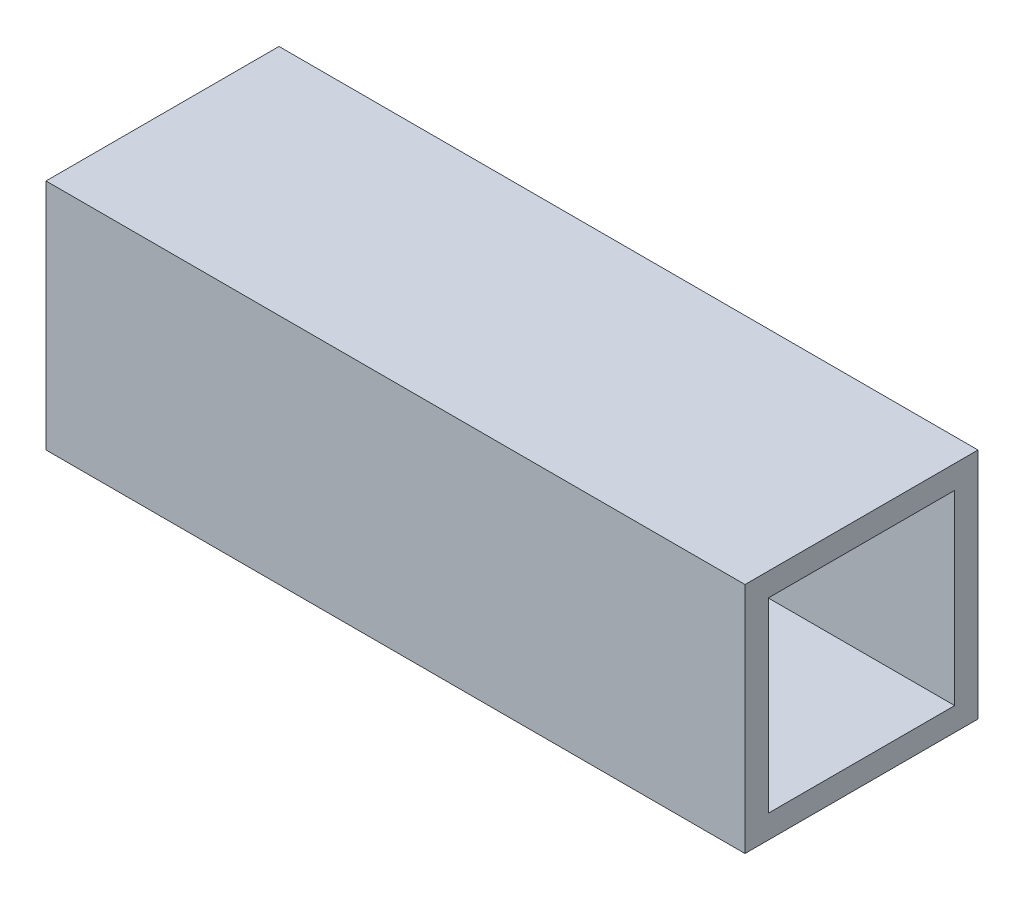
ISO-10303-21;
HEADER;
FILE_DESCRIPTION(('STEP AP214'),'2;1');
FILE_NAME('part.step','',(''),(''),'','','');
FILE_SCHEMA(('AUTOMOTIVE_DESIGN { 1 0 10303 214 1 1 1 1 }'));
ENDSEC;
DATA;
#1=APPLICATION_CONTEXT('core data for automotive mechanical design processes');
#2=APPLICATION_PROTOCOL_DEFINITION('international standard','automotive_design',2000,#1);
#3=PRODUCT_CONTEXT('',#1,'mechanical');
#4=PRODUCT('Part','Part','',(#3));
#5=PRODUCT_RELATED_PRODUCT_CATEGORY('part','',(#4));
#6=PRODUCT_DEFINITION_FORMATION('','',#4);
#7=PRODUCT_DEFINITION_CONTEXT('part definition',#1,'design');
#8=PRODUCT_DEFINITION('design','',#6,#7);
#9=PRODUCT_DEFINITION_SHAPE('','',#8);
#10=(LENGTH_UNIT() NAMED_UNIT(*) SI_UNIT(.MILLI.,.METRE.));
#11=(NAMED_UNIT(*) PLANE_ANGLE_UNIT() SI_UNIT($,.RADIAN.));
#12=(NAMED_UNIT(*) SI_UNIT($,.STERADIAN.) SOLID_ANGLE_UNIT());
#13=UNCERTAINTY_MEASURE_WITH_UNIT(LENGTH_MEASURE(1.E-05),#10,'distance_accuracy_value','');
#14=(GEOMETRIC_REPRESENTATION_CONTEXT(3) GLOBAL_UNCERTAINTY_ASSIGNED_CONTEXT((#13)) GLOBAL_UNIT_ASSIGNED_CONTEXT((#10,
#11,#12)) REPRESENTATION_CONTEXT('',''));
#15=CARTESIAN_POINT('',(0.,0.,0.));
#16=DIRECTION('',(0.,0.,1.));
#17=DIRECTION('',(1.,0.,0.));
#18=AXIS2_PLACEMENT_3D('',#15,#16,#17);
#19=CARTESIAN_POINT('',(45.,0.,0.));
#20=DIRECTION('',(1.,0.,0.));
#21=DIRECTION('',(0.,0.,-1.));
#22=AXIS2_PLACEMENT_3D('',#19,#20,#21);
#23=PLANE('',#22);
#24=DIRECTION('',(0.,1.,0.));
#25=VECTOR('',#24,1.);
#26=CARTESIAN_POINT('',(45.,7.5,-7.5));
#27=LINE('',#26,#25);
#28=CARTESIAN_POINT('',(45.,-7.5,-7.5));
#29=VERTEX_POINT('',#28);
#30=CARTESIAN_POINT('',(45.,7.5,-7.5));
#31=VERTEX_POINT('',#30);
#32=EDGE_CURVE('E134',#29,#31,#27,.T.);
#33=ORIENTED_EDGE('',*,*,#32,.T.);
#34=DIRECTION('',(0.,0.,1.));
#35=VECTOR('',#34,1.);
#36=CARTESIAN_POINT('',(45.,7.5,7.5));
#37=LINE('',#36,#35);
#38=CARTESIAN_POINT('',(45.,7.5,7.5));
#39=VERTEX_POINT('',#38);
#40=EDGE_CURVE('E137',#31,#39,#37,.T.);
#41=ORIENTED_EDGE('',*,*,#40,.T.);
#42=DIRECTION('',(0.,-1.,0.));
#43=VECTOR('',#42,1.);
#44=CARTESIAN_POINT('',(45.,7.5,7.5));
#45=LINE('',#44,#43);
#46=CARTESIAN_POINT('',(45.,-7.5,7.5));
#47=VERTEX_POINT('',#46);
#48=EDGE_CURVE('E140',#39,#47,#45,.T.);
#49=ORIENTED_EDGE('',*,*,#48,.T.);
#50=DIRECTION('',(0.,0.,-1.));
#51=VECTOR('',#50,1.);
#52=CARTESIAN_POINT('',(45.,-7.5,7.5));
#53=LINE('',#52,#51);
#54=EDGE_CURVE('E142',#47,#29,#53,.T.);
#55=ORIENTED_EDGE('',*,*,#54,.T.);
#56=EDGE_LOOP('',(#33,#41,#49,#55));
#57=FACE_BOUND('',#56,.T.);
#58=DIRECTION('',(0.,0.,-1.));
#59=VECTOR('',#58,1.);
#60=CARTESIAN_POINT('',(45.,-6.,6.));
#61=LINE('',#60,#59);
#62=CARTESIAN_POINT('',(45.,-6.,6.));
#63=VERTEX_POINT('',#62);
#64=CARTESIAN_POINT('',(45.,-6.,-6.));
#65=VERTEX_POINT('',#64);
#66=EDGE_CURVE('E106',#63,#65,#61,.T.);
#67=ORIENTED_EDGE('',*,*,#66,.F.);
#68=DIRECTION('',(0.,-1.,0.));
#69=VECTOR('',#68,1.);
#70=CARTESIAN_POINT('',(45.,6.,6.));
#71=LINE('',#70,#69);
#72=CARTESIAN_POINT('',(45.,6.,6.));
#73=VERTEX_POINT('',#72);
#74=EDGE_CURVE('E98',#73,#63,#71,.T.);
#75=ORIENTED_EDGE('',*,*,#74,.F.);
#76=DIRECTION('',(0.,0.,1.));
#77=VECTOR('',#76,1.);
#78=CARTESIAN_POINT('',(45.,6.,6.));
#79=LINE('',#78,#77);
#80=CARTESIAN_POINT('',(45.,6.,-6.));
#81=VERTEX_POINT('',#80);
#82=EDGE_CURVE('E120',#81,#73,#79,.T.);
#83=ORIENTED_EDGE('',*,*,#82,.F.);
#84=DIRECTION('',(0.,1.,0.));
#85=VECTOR('',#84,1.);
#86=CARTESIAN_POINT('',(45.,6.,-6.));
#87=LINE('',#86,#85);
#88=EDGE_CURVE('E118',#65,#81,#87,.T.);
#89=ORIENTED_EDGE('',*,*,#88,.F.);
#90=EDGE_LOOP('',(#67,#75,#83,#89));
#91=FACE_BOUND('',#90,.T.);
#92=ADVANCED_FACE('F33',(#57,#91),#23,.T.);
#93=CARTESIAN_POINT('',(0.,0.,0.));
#94=DIRECTION('',(1.,0.,0.));
#95=DIRECTION('',(0.,0.,-1.));
#96=AXIS2_PLACEMENT_3D('',#93,#94,#95);
#97=PLANE('',#96);
#98=DIRECTION('',(0.,1.,0.));
#99=VECTOR('',#98,1.);
#100=CARTESIAN_POINT('',(0.,7.5,-7.5));
#101=LINE('',#100,#99);
#102=CARTESIAN_POINT('',(0.,-7.5,-7.5));
#103=VERTEX_POINT('',#102);
#104=CARTESIAN_POINT('',(0.,7.5,-7.5));
#105=VERTEX_POINT('',#104);
#106=EDGE_CURVE('E114',#103,#105,#101,.T.);
#107=ORIENTED_EDGE('',*,*,#106,.F.);
#108=DIRECTION('',(0.,0.,-1.));
#109=VECTOR('',#108,1.);
#110=CARTESIAN_POINT('',(0.,-7.5,7.5));
#111=LINE('',#110,#109);
#112=CARTESIAN_POINT('',(0.,-7.5,7.5));
#113=VERTEX_POINT('',#112);
#114=EDGE_CURVE('E138',#113,#103,#111,.T.);
#115=ORIENTED_EDGE('',*,*,#114,.F.);
#116=DIRECTION('',(0.,-1.,0.));
#117=VECTOR('',#116,1.);
#118=CARTESIAN_POINT('',(0.,7.5,7.5));
#119=LINE('',#118,#117);
#120=CARTESIAN_POINT('',(0.,7.5,7.5));
#121=VERTEX_POINT('',#120);
#122=EDGE_CURVE('E149',#121,#113,#119,.T.);
#123=ORIENTED_EDGE('',*,*,#122,.F.);
#124=DIRECTION('',(0.,0.,1.));
#125=VECTOR('',#124,1.);
#126=CARTESIAN_POINT('',(0.,7.5,7.5));
#127=LINE('',#126,#125);
#128=EDGE_CURVE('E147',#105,#121,#127,.T.);
#129=ORIENTED_EDGE('',*,*,#128,.F.);
#130=EDGE_LOOP('',(#107,#115,#123,#129));
#131=FACE_BOUND('',#130,.T.);
#132=DIRECTION('',(0.,-1.,0.));
#133=VECTOR('',#132,1.);
#134=CARTESIAN_POINT('',(0.,6.,6.));
#135=LINE('',#134,#133);
#136=CARTESIAN_POINT('',(0.,6.,6.));
#137=VERTEX_POINT('',#136);
#138=CARTESIAN_POINT('',(0.,-6.,6.));
#139=VERTEX_POINT('',#138);
#140=EDGE_CURVE('E56',#137,#139,#135,.T.);
#141=ORIENTED_EDGE('',*,*,#140,.T.);
#142=DIRECTION('',(0.,0.,-1.));
#143=VECTOR('',#142,1.);
#144=CARTESIAN_POINT('',(0.,-6.,6.));
#145=LINE('',#144,#143);
#146=CARTESIAN_POINT('',(0.,-6.,-6.));
#147=VERTEX_POINT('',#146);
#148=EDGE_CURVE('E113',#139,#147,#145,.T.);
#149=ORIENTED_EDGE('',*,*,#148,.T.);
#150=DIRECTION('',(0.,1.,0.));
#151=VECTOR('',#150,1.);
#152=CARTESIAN_POINT('',(0.,6.,-6.));
#153=LINE('',#152,#151);
#154=CARTESIAN_POINT('',(0.,6.,-6.));
#155=VERTEX_POINT('',#154);
#156=EDGE_CURVE('E126',#147,#155,#153,.T.);
#157=ORIENTED_EDGE('',*,*,#156,.T.);
#158=DIRECTION('',(0.,0.,1.));
#159=VECTOR('',#158,1.);
#160=CARTESIAN_POINT('',(0.,6.,6.));
#161=LINE('',#160,#159);
#162=EDGE_CURVE('E107',#155,#137,#161,.T.);
#163=ORIENTED_EDGE('',*,*,#162,.T.);
#164=EDGE_LOOP('',(#141,#149,#157,#163));
#165=FACE_BOUND('',#164,.T.);
#166=ADVANCED_FACE('F167',(#131,#165),#97,.F.);
#167=CARTESIAN_POINT('',(45.,7.5,-7.5));
#168=DIRECTION('',(0.,0.,1.));
#169=DIRECTION('',(0.,-1.,0.));
#170=AXIS2_PLACEMENT_3D('',#167,#168,#169);
#171=PLANE('',#170);
#172=ORIENTED_EDGE('',*,*,#106,.T.);
#173=DIRECTION('',(-1.,0.,0.));
#174=VECTOR('',#173,1.);
#175=CARTESIAN_POINT('',(45.,7.5,-7.5));
#176=LINE('',#175,#174);
#177=EDGE_CURVE('E11',#31,#105,#176,.T.);
#178=ORIENTED_EDGE('',*,*,#177,.F.);
#179=ORIENTED_EDGE('',*,*,#32,.F.);
#180=DIRECTION('',(-1.,0.,0.));
#181=VECTOR('',#180,1.);
#182=CARTESIAN_POINT('',(45.,-7.5,-7.5));
#183=LINE('',#182,#181);
#184=EDGE_CURVE('E144',#29,#103,#183,.T.);
#185=ORIENTED_EDGE('',*,*,#184,.T.);
#186=EDGE_LOOP('',(#172,#178,#179,#185));
#187=FACE_BOUND('',#186,.T.);
#188=ADVANCED_FACE('F35',(#187),#171,.F.);
#189=CARTESIAN_POINT('',(45.,7.5,7.5));
#190=DIRECTION('',(0.,-1.,0.));
#191=DIRECTION('',(0.,0.,-1.));
#192=AXIS2_PLACEMENT_3D('',#189,#190,#191);
#193=PLANE('',#192);
#194=ORIENTED_EDGE('',*,*,#128,.T.);
#195=DIRECTION('',(-1.,0.,0.));
#196=VECTOR('',#195,1.);
#197=CARTESIAN_POINT('',(45.,7.5,7.5));
#198=LINE('',#197,#196);
#199=EDGE_CURVE('E41',#39,#121,#198,.T.);
#200=ORIENTED_EDGE('',*,*,#199,.F.);
#201=ORIENTED_EDGE('',*,*,#40,.F.);
#202=ORIENTED_EDGE('',*,*,#177,.T.);
#203=EDGE_LOOP('',(#194,#200,#201,#202));
#204=FACE_BOUND('',#203,.T.);
#205=ADVANCED_FACE('F177',(#204),#193,.F.);
#206=CARTESIAN_POINT('',(45.,7.5,7.5));
#207=DIRECTION('',(0.,0.,-1.));
#208=DIRECTION('',(0.,1.,0.));
#209=AXIS2_PLACEMENT_3D('',#206,#207,#208);
#210=PLANE('',#209);
#211=ORIENTED_EDGE('',*,*,#122,.T.);
#212=DIRECTION('',(-1.,0.,0.));
#213=VECTOR('',#212,1.);
#214=CARTESIAN_POINT('',(45.,-7.5,7.5));
#215=LINE('',#214,#213);
#216=EDGE_CURVE('E154',#47,#113,#215,.T.);
#217=ORIENTED_EDGE('',*,*,#216,.F.);
#218=ORIENTED_EDGE('',*,*,#48,.F.);
#219=ORIENTED_EDGE('',*,*,#199,.T.);
#220=EDGE_LOOP('',(#211,#217,#218,#219));
#221=FACE_BOUND('',#220,.T.);
#222=ADVANCED_FACE('F161',(#221),#210,.F.);
#223=CARTESIAN_POINT('',(45.,-7.5,7.5));
#224=DIRECTION('',(0.,1.,0.));
#225=DIRECTION('',(0.,0.,1.));
#226=AXIS2_PLACEMENT_3D('',#223,#224,#225);
#227=PLANE('',#226);
#228=ORIENTED_EDGE('',*,*,#114,.T.);
#229=ORIENTED_EDGE('',*,*,#184,.F.);
#230=ORIENTED_EDGE('',*,*,#54,.F.);
#231=ORIENTED_EDGE('',*,*,#216,.T.);
#232=EDGE_LOOP('',(#228,#229,#230,#231));
#233=FACE_BOUND('',#232,.T.);
#234=ADVANCED_FACE('F171',(#233),#227,.F.);
#235=CARTESIAN_POINT('',(45.,6.,6.));
#236=DIRECTION('',(0.,0.,-1.));
#237=DIRECTION('',(0.,1.,0.));
#238=AXIS2_PLACEMENT_3D('',#235,#236,#237);
#239=PLANE('',#238);
#240=ORIENTED_EDGE('',*,*,#140,.F.);
#241=DIRECTION('',(-1.,0.,0.));
#242=VECTOR('',#241,1.);
#243=CARTESIAN_POINT('',(45.,6.,6.));
#244=LINE('',#243,#242);
#245=EDGE_CURVE('E102',#73,#137,#244,.T.);
#246=ORIENTED_EDGE('',*,*,#245,.F.);
#247=ORIENTED_EDGE('',*,*,#74,.T.);
#248=DIRECTION('',(-1.,0.,0.));
#249=VECTOR('',#248,1.);
#250=CARTESIAN_POINT('',(45.,-6.,6.));
#251=LINE('',#250,#249);
#252=EDGE_CURVE('E101',#63,#139,#251,.T.);
#253=ORIENTED_EDGE('',*,*,#252,.T.);
#254=EDGE_LOOP('',(#240,#246,#247,#253));
#255=FACE_BOUND('',#254,.T.);
#256=ADVANCED_FACE('F100',(#255),#239,.T.);
#257=CARTESIAN_POINT('',(45.,-6.,6.));
#258=DIRECTION('',(0.,1.,0.));
#259=DIRECTION('',(0.,0.,1.));
#260=AXIS2_PLACEMENT_3D('',#257,#258,#259);
#261=PLANE('',#260);
#262=ORIENTED_EDGE('',*,*,#148,.F.);
#263=ORIENTED_EDGE('',*,*,#252,.F.);
#264=ORIENTED_EDGE('',*,*,#66,.T.);
#265=DIRECTION('',(-1.,0.,0.));
#266=VECTOR('',#265,1.);
#267=CARTESIAN_POINT('',(45.,-6.,-6.));
#268=LINE('',#267,#266);
#269=EDGE_CURVE('E115',#65,#147,#268,.T.);
#270=ORIENTED_EDGE('',*,*,#269,.T.);
#271=EDGE_LOOP('',(#262,#263,#264,#270));
#272=FACE_BOUND('',#271,.T.);
#273=ADVANCED_FACE('F110',(#272),#261,.T.);
#274=CARTESIAN_POINT('',(45.,6.,-6.));
#275=DIRECTION('',(0.,0.,1.));
#276=DIRECTION('',(0.,-1.,0.));
#277=AXIS2_PLACEMENT_3D('',#274,#275,#276);
#278=PLANE('',#277);
#279=ORIENTED_EDGE('',*,*,#156,.F.);
#280=ORIENTED_EDGE('',*,*,#269,.F.);
#281=ORIENTED_EDGE('',*,*,#88,.T.);
#282=DIRECTION('',(-1.,0.,0.));
#283=VECTOR('',#282,1.);
#284=CARTESIAN_POINT('',(45.,6.,-6.));
#285=LINE('',#284,#283);
#286=EDGE_CURVE('E48',#81,#155,#285,.T.);
#287=ORIENTED_EDGE('',*,*,#286,.T.);
#288=EDGE_LOOP('',(#279,#280,#281,#287));
#289=FACE_BOUND('',#288,.T.);
#290=ADVANCED_FACE('F200',(#289),#278,.T.);
#291=CARTESIAN_POINT('',(45.,6.,6.));
#292=DIRECTION('',(0.,-1.,0.));
#293=DIRECTION('',(0.,0.,-1.));
#294=AXIS2_PLACEMENT_3D('',#291,#292,#293);
#295=PLANE('',#294);
#296=ORIENTED_EDGE('',*,*,#162,.F.);
#297=ORIENTED_EDGE('',*,*,#286,.F.);
#298=ORIENTED_EDGE('',*,*,#82,.T.);
#299=ORIENTED_EDGE('',*,*,#245,.T.);
#300=EDGE_LOOP('',(#296,#297,#298,#299));
#301=FACE_BOUND('',#300,.T.);
#302=ADVANCED_FACE('F204',(#301),#295,.T.);
#303=CLOSED_SHELL('',(#92,#166,#188,#205,#222,#234,#256,#273,#290,#302));
#304=MANIFOLD_SOLID_BREP('B2',#303);
#305=ADVANCED_BREP_SHAPE_REPRESENTATION('',(#18,#304),#14);
#306=SHAPE_DEFINITION_REPRESENTATION(#9,#305);
ENDSEC;
END-ISO-10303-21;
